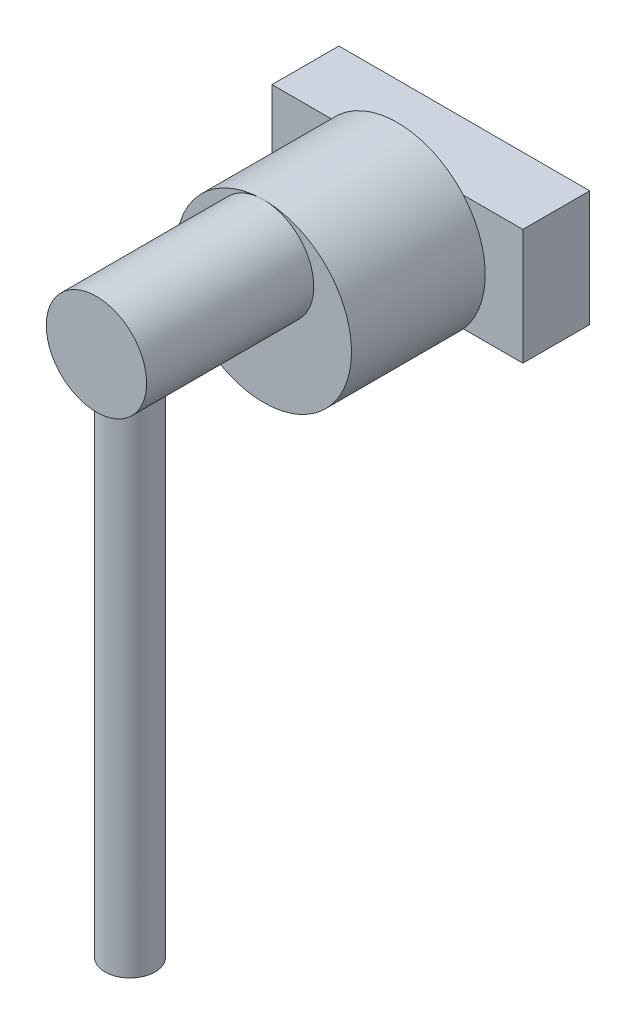
ISO-10303-21;
HEADER;
FILE_DESCRIPTION(('STEP AP214'),'2;1');
FILE_NAME('part.step','',(''),(''),'','','');
FILE_SCHEMA(('AUTOMOTIVE_DESIGN { 1 0 10303 214 1 1 1 1 }'));
ENDSEC;
DATA;
#1=APPLICATION_CONTEXT('core data for automotive mechanical design processes');
#2=APPLICATION_PROTOCOL_DEFINITION('international standard','automotive_design',2000,#1);
#3=PRODUCT_CONTEXT('',#1,'mechanical');
#4=PRODUCT('Part','Part','',(#3));
#5=PRODUCT_RELATED_PRODUCT_CATEGORY('part','',(#4));
#6=PRODUCT_DEFINITION_FORMATION('','',#4);
#7=PRODUCT_DEFINITION_CONTEXT('part definition',#1,'design');
#8=PRODUCT_DEFINITION('design','',#6,#7);
#9=PRODUCT_DEFINITION_SHAPE('','',#8);
#10=(LENGTH_UNIT() NAMED_UNIT(*) SI_UNIT(.MILLI.,.METRE.));
#11=(NAMED_UNIT(*) PLANE_ANGLE_UNIT() SI_UNIT($,.RADIAN.));
#12=(NAMED_UNIT(*) SI_UNIT($,.STERADIAN.) SOLID_ANGLE_UNIT());
#13=UNCERTAINTY_MEASURE_WITH_UNIT(LENGTH_MEASURE(1.E-05),#10,'distance_accuracy_value','');
#14=(GEOMETRIC_REPRESENTATION_CONTEXT(3) GLOBAL_UNCERTAINTY_ASSIGNED_CONTEXT((#13)) GLOBAL_UNIT_ASSIGNED_CONTEXT((#10,
#11,#12)) REPRESENTATION_CONTEXT('',''));
#15=CARTESIAN_POINT('',(0.,0.,0.));
#16=DIRECTION('',(0.,0.,1.));
#17=DIRECTION('',(1.,0.,0.));
#18=AXIS2_PLACEMENT_3D('',#15,#16,#17);
#19=CARTESIAN_POINT('',(0.,0.,76.2));
#20=DIRECTION('',(0.,0.,-1.));
#21=DIRECTION('',(-1.,0.,0.));
#22=AXIS2_PLACEMENT_3D('',#19,#20,#21);
#23=CYLINDRICAL_SURFACE('',#22,33.3375);
#24=CARTESIAN_POINT('',(0.,0.,25.4));
#25=DIRECTION('',(0.,0.,1.));
#26=DIRECTION('',(-1.,0.,0.));
#27=AXIS2_PLACEMENT_3D('',#24,#25,#26);
#28=CIRCLE('',#27,33.3375);
#29=CARTESIAN_POINT('',(-25.0477325570599,22.,25.4));
#30=VERTEX_POINT('',#29);
#31=CARTESIAN_POINT('',(-25.0477325570599,-22.,25.4));
#32=VERTEX_POINT('',#31);
#33=EDGE_CURVE('E81',#30,#32,#28,.T.);
#34=ORIENTED_EDGE('',*,*,#33,.T.);
#35=CARTESIAN_POINT('',(0.,0.,25.4));
#36=DIRECTION('',(0.,0.,1.));
#37=DIRECTION('',(-1.,0.,0.));
#38=AXIS2_PLACEMENT_3D('',#35,#36,#37);
#39=CIRCLE('',#38,33.3375);
#40=CARTESIAN_POINT('',(25.0477325570599,-22.,25.4));
#41=VERTEX_POINT('',#40);
#42=EDGE_CURVE('E85',#32,#41,#39,.T.);
#43=ORIENTED_EDGE('',*,*,#42,.T.);
#44=CARTESIAN_POINT('',(0.,0.,25.4));
#45=DIRECTION('',(0.,0.,1.));
#46=DIRECTION('',(-1.,0.,0.));
#47=AXIS2_PLACEMENT_3D('',#44,#45,#46);
#48=CIRCLE('',#47,33.3375);
#49=CARTESIAN_POINT('',(25.0477325570599,22.,25.4));
#50=VERTEX_POINT('',#49);
#51=EDGE_CURVE('E31',#41,#50,#48,.T.);
#52=ORIENTED_EDGE('',*,*,#51,.T.);
#53=CARTESIAN_POINT('',(0.,0.,25.4));
#54=DIRECTION('',(0.,0.,1.));
#55=DIRECTION('',(-1.,0.,0.));
#56=AXIS2_PLACEMENT_3D('',#53,#54,#55);
#57=CIRCLE('',#56,33.3375);
#58=EDGE_CURVE('E86',#50,#30,#57,.T.);
#59=ORIENTED_EDGE('',*,*,#58,.T.);
#60=EDGE_LOOP('',(#34,#43,#52,#59));
#61=FACE_BOUND('',#60,.T.);
#62=CARTESIAN_POINT('',(0.,0.,76.2));
#63=DIRECTION('',(0.,0.,-1.));
#64=DIRECTION('',(-1.,0.,0.));
#65=AXIS2_PLACEMENT_3D('',#62,#63,#64);
#66=CIRCLE('',#65,33.3375);
#67=CARTESIAN_POINT('',(0.,33.3375,76.2));
#68=VERTEX_POINT('',#67);
#69=EDGE_CURVE('E11',#68,#68,#66,.T.);
#70=ORIENTED_EDGE('',*,*,#69,.T.);
#71=EDGE_LOOP('',(#70));
#72=FACE_BOUND('',#71,.T.);
#73=ADVANCED_FACE('F16',(#61,#72),#23,.T.);
#74=CARTESIAN_POINT('',(0.,-190.5,126.942779755271));
#75=DIRECTION('',(0.,1.,0.));
#76=DIRECTION('',(0.,0.,1.));
#77=AXIS2_PLACEMENT_3D('',#74,#75,#76);
#78=CYLINDRICAL_SURFACE('',#77,9.52500000000001);
#79=CARTESIAN_POINT('',(0.,-4.7625,117.417779755271));
#80=CARTESIAN_POINT('',(0.25067092690493,-4.76250491696352,117.417774106221));
#81=CARTESIAN_POINT('',(0.501282882398853,-4.75754398678024,117.427681329356));
#82=CARTESIAN_POINT('',(1.00064222701787,-4.73784110377864,117.467177273856));
#83=CARTESIAN_POINT('',(1.24938922307418,-4.72309714456443,117.49677003252));
#84=CARTESIAN_POINT('',(1.74326699327054,-4.68418831822216,117.57532332017));
#85=CARTESIAN_POINT('',(1.98839439690143,-4.66001518230058,117.624300848931));
#86=CARTESIAN_POINT('',(2.47306145882082,-4.60286810479089,117.741055864461));
#87=CARTESIAN_POINT('',(2.71260134798185,-4.56989452753437,117.808832572962));
#88=CARTESIAN_POINT('',(3.18367976176072,-4.49609203942614,117.962192170798));
#89=CARTESIAN_POINT('',(3.41524391697784,-4.4552917450615,118.047710283064));
#90=CARTESIAN_POINT('',(3.86990663546901,-4.36672125635948,118.235886796309));
#91=CARTESIAN_POINT('',(4.09300513680623,-4.31895101104058,118.338545322661));
#92=CARTESIAN_POINT('',(4.52952109184044,-4.2175302506639,118.560120962896));
#93=CARTESIAN_POINT('',(4.74294012548301,-4.16388070018388,118.679035410569));
#94=CARTESIAN_POINT('',(5.15920547678612,-4.05184520303124,118.932310985793));
#95=CARTESIAN_POINT('',(5.36204757922594,-3.99345739136225,119.066678204373));
#96=CARTESIAN_POINT('',(5.76806922461112,-3.86958116121294,119.358505715835));
#97=CARTESIAN_POINT('',(5.97053386905561,-3.8038768856618,119.516869289623));
#98=CARTESIAN_POINT('',(6.36157867052324,-3.67010368679475,119.848996687232));
#99=CARTESIAN_POINT('',(6.55015803318135,-3.60203462851903,120.022761390887));
#100=CARTESIAN_POINT('',(6.91267977130811,-3.46510333151833,120.384871785093));
#101=CARTESIAN_POINT('',(7.08661351340234,-3.39624065177996,120.573225952055));
#102=CARTESIAN_POINT('',(7.41891766995845,-3.25942163397795,120.96356580246));
#103=CARTESIAN_POINT('',(7.5772851594479,-3.19146546831808,121.165554035827));
#104=CARTESIAN_POINT('',(7.88928200572318,-3.05300414351728,121.59848582946));
#105=CARTESIAN_POINT('',(8.04158127777333,-2.98271278872064,121.830459266949));
#106=CARTESIAN_POINT('',(8.32588849111664,-2.84746027235705,122.307873285036));
#107=CARTESIAN_POINT('',(8.45790502993469,-2.78249685783587,122.553308099372));
#108=CARTESIAN_POINT('',(8.70050324157085,-2.66013130143966,123.056290705558));
#109=CARTESIAN_POINT('',(8.81109131873917,-2.60272690204124,123.313834849594));
#110=CARTESIAN_POINT('',(9.00964497717165,-2.49765517258362,123.839425062946));
#111=CARTESIAN_POINT('',(9.0976130651066,-2.44998676373537,124.107469964807));
#112=CARTESIAN_POINT('',(9.24520740302859,-2.36888937148875,124.635743502098));
#113=CARTESIAN_POINT('',(9.30621352461951,-2.33477952283524,124.895481545254));
#114=CARTESIAN_POINT('',(9.40634895105267,-2.27832083862825,125.420413331775));
#115=CARTESIAN_POINT('',(9.44547919172484,-2.25597149997345,125.685606841256));
#116=CARTESIAN_POINT('',(9.50123288261028,-2.22401453180965,126.218891937457));
#117=CARTESIAN_POINT('',(9.51787531224036,-2.21439615767436,126.48698088757));
#118=CARTESIAN_POINT('',(9.52843663979708,-2.20830074795434,127.023743953905));
#119=CARTESIAN_POINT('',(9.52235770570331,-2.21182245859641,127.292418011854));
#120=CARTESIAN_POINT('',(9.48967778688657,-2.23063535925795,127.795653045898));
#121=CARTESIAN_POINT('',(9.46562595460762,-2.24446409038839,128.030440108235));
#122=CARTESIAN_POINT('',(9.40030646244944,-2.28169289937264,128.496916903453));
#123=CARTESIAN_POINT('',(9.35903311243631,-2.30509614067498,128.728605586466));
#124=CARTESIAN_POINT('',(9.2597548192715,-2.36070312704522,129.187243734083));
#125=CARTESIAN_POINT('',(9.20175215649459,-2.39290567264735,129.414193840086));
#126=CARTESIAN_POINT('',(9.0695904876735,-2.46513244811679,129.862148358766));
#127=CARTESIAN_POINT('',(8.99542503355187,-2.50515979899898,130.083150358825));
#128=CARTESIAN_POINT('',(8.82974833920996,-2.59287389894596,130.522953967367));
#129=CARTESIAN_POINT('',(8.73787928389968,-2.64071484433219,130.741589741636));
#130=CARTESIAN_POINT('',(8.53866258088931,-2.74206925881253,131.17040118048));
#131=CARTESIAN_POINT('',(8.43130979049634,-2.79558461100646,131.380574004425));
#132=CARTESIAN_POINT('',(8.20185612104422,-2.90692684706438,131.791550627954));
#133=CARTESIAN_POINT('',(8.07975291013749,-2.96475441207808,131.99235293921));
#134=CARTESIAN_POINT('',(7.82150366294823,-3.08335982391517,132.383799471538));
#135=CARTESIAN_POINT('',(7.68535677165925,-3.14413785024897,132.574443073056));
#136=CARTESIAN_POINT('',(7.38153095644948,-3.27513713861021,132.9684006445));
#137=CARTESIAN_POINT('',(7.21204328673772,-3.34557758157693,133.170249927116));
#138=CARTESIAN_POINT('',(6.85702801743778,-3.48664248215145,133.559130379429));
#139=CARTESIAN_POINT('',(6.67150443893934,-3.55726688934607,133.746165241508));
#140=CARTESIAN_POINT('',(6.28513261318282,-3.69698870315239,134.104638854419));
#141=CARTESIAN_POINT('',(6.08427291566825,-3.76608491815365,134.27606573847));
#142=CARTESIAN_POINT('',(5.6682866774142,-3.90098101375024,134.602153409784));
#143=CARTESIAN_POINT('',(5.45315829197509,-3.96678046619216,134.756812022356));
#144=CARTESIAN_POINT('',(4.99922594062599,-4.0964206483593,135.05515072214));
#145=CARTESIAN_POINT('',(4.75978351718836,-4.16002174612098,135.197966222729));
#146=CARTESIAN_POINT('',(4.26797596767547,-4.27996925349622,135.462636021021));
#147=CARTESIAN_POINT('',(4.01561662645192,-4.33631887163627,135.584499597294));
#148=CARTESIAN_POINT('',(3.49991235877756,-4.4400776791065,135.805897081463));
#149=CARTESIAN_POINT('',(3.23658303905939,-4.48749907337021,135.905461508269));
#150=CARTESIAN_POINT('',(2.70075199057212,-4.57203364237769,136.081218209056));
#151=CARTESIAN_POINT('',(2.42825383506503,-4.60915078188221,136.157419473646));
#152=CARTESIAN_POINT('',(1.80119860581986,-4.68044148465766,136.302857058946));
#153=CARTESIAN_POINT('',(1.44445784317496,-4.71107677673519,136.364578937776));
#154=CARTESIAN_POINT('',(0.725103224055987,-4.75210147612539,136.447034170594));
#155=CARTESIAN_POINT('',(0.362489953161313,-4.76249288968251,136.467771586299));
#156=CARTESIAN_POINT('',(-0.25067092690493,-4.76250491696352,136.467785404322));
#157=CARTESIAN_POINT('',(-0.501282882398852,-4.75754398678024,136.457878181187));
#158=CARTESIAN_POINT('',(-1.00064222701787,-4.73784110377865,136.418382236687));
#159=CARTESIAN_POINT('',(-1.24938922307418,-4.72309714456444,136.388789478023));
#160=CARTESIAN_POINT('',(-1.74326699327053,-4.68418831822216,136.310236190373));
#161=CARTESIAN_POINT('',(-1.98839439690143,-4.66001518230058,136.261258661612));
#162=CARTESIAN_POINT('',(-2.47306145882081,-4.60286810479089,136.144503646082));
#163=CARTESIAN_POINT('',(-2.71260134798184,-4.56989452753437,136.076726937581));
#164=CARTESIAN_POINT('',(-3.18367976176072,-4.49609203942614,135.923367339745));
#165=CARTESIAN_POINT('',(-3.41524391697784,-4.45529174506149,135.837849227479));
#166=CARTESIAN_POINT('',(-3.86990663546902,-4.36672125635948,135.649672714234));
#167=CARTESIAN_POINT('',(-4.09300513680623,-4.31895101104058,135.547014187881));
#168=CARTESIAN_POINT('',(-4.52952109184044,-4.2175302506639,135.325438547647));
#169=CARTESIAN_POINT('',(-4.74294012548302,-4.16388070018388,135.206524099973));
#170=CARTESIAN_POINT('',(-5.15920547678612,-4.05184520303124,134.95324852475));
#171=CARTESIAN_POINT('',(-5.36204757922594,-3.99345739136225,134.81888130617));
#172=CARTESIAN_POINT('',(-5.76806922461112,-3.86958116121294,134.527053794708));
#173=CARTESIAN_POINT('',(-5.97053386905561,-3.80387688566179,134.36869022092));
#174=CARTESIAN_POINT('',(-6.36157867052324,-3.67010368679475,134.036562823311));
#175=CARTESIAN_POINT('',(-6.55015803318134,-3.60203462851904,133.862798119656));
#176=CARTESIAN_POINT('',(-6.91267977130811,-3.46510333151834,133.50068772545));
#177=CARTESIAN_POINT('',(-7.08661351340233,-3.39624065177996,133.312333558488));
#178=CARTESIAN_POINT('',(-7.41891766995845,-3.25942163397794,132.921993708083));
#179=CARTESIAN_POINT('',(-7.5772851594479,-3.19146546831808,132.720005474716));
#180=CARTESIAN_POINT('',(-7.88928200572318,-3.05300414351728,132.287073681083));
#181=CARTESIAN_POINT('',(-8.04158127777334,-2.98271278872063,132.055100243594));
#182=CARTESIAN_POINT('',(-8.32588849111666,-2.84746027235704,131.577686225507));
#183=CARTESIAN_POINT('',(-8.4579050299347,-2.78249685783586,131.332251411171));
#184=CARTESIAN_POINT('',(-8.70050324157086,-2.66013130143965,130.829268804985));
#185=CARTESIAN_POINT('',(-8.81109131873917,-2.60272690204123,130.571724660949));
#186=CARTESIAN_POINT('',(-9.00964497717165,-2.49765517258362,130.046134447597));
#187=CARTESIAN_POINT('',(-9.09761306510661,-2.44998676373537,129.778089545736));
#188=CARTESIAN_POINT('',(-9.24520740302859,-2.36888937148875,129.249816008444));
#189=CARTESIAN_POINT('',(-9.3062135246195,-2.33477952283524,128.990077965288));
#190=CARTESIAN_POINT('',(-9.40634895105267,-2.27832083862825,128.465146178768));
#191=CARTESIAN_POINT('',(-9.44547919172483,-2.25597149997345,128.199952669287));
#192=CARTESIAN_POINT('',(-9.50123288261028,-2.22401453180964,127.666667573086));
#193=CARTESIAN_POINT('',(-9.51787531224036,-2.21439615767436,127.398578622973));
#194=CARTESIAN_POINT('',(-9.52843663979708,-2.20830074795434,126.861815556638));
#195=CARTESIAN_POINT('',(-9.52235770570331,-2.21182245859641,126.593141498689));
#196=CARTESIAN_POINT('',(-9.48967778688657,-2.23063535925794,126.089906464645));
#197=CARTESIAN_POINT('',(-9.46562595460762,-2.24446409038838,125.855119402308));
#198=CARTESIAN_POINT('',(-9.40030646244944,-2.28169289937264,125.38864260709));
#199=CARTESIAN_POINT('',(-9.3590331124363,-2.30509614067499,125.156953924077));
#200=CARTESIAN_POINT('',(-9.25975481927149,-2.36070312704522,124.698315776459));
#201=CARTESIAN_POINT('',(-9.20175215649458,-2.39290567264735,124.471365670457));
#202=CARTESIAN_POINT('',(-9.06959048767349,-2.46513244811679,124.023411151777));
#203=CARTESIAN_POINT('',(-8.99542503355187,-2.50515979899898,123.802409151718));
#204=CARTESIAN_POINT('',(-8.82974833920995,-2.59287389894596,123.362605543176));
#205=CARTESIAN_POINT('',(-8.73787928389967,-2.64071484433219,123.143969768906));
#206=CARTESIAN_POINT('',(-8.53866258088929,-2.74206925881254,122.715158330063));
#207=CARTESIAN_POINT('',(-8.43130979049633,-2.79558461100646,122.504985506118));
#208=CARTESIAN_POINT('',(-8.20185612104421,-2.90692684706439,122.094008882589));
#209=CARTESIAN_POINT('',(-8.07975291013749,-2.96475441207809,121.893206571333));
#210=CARTESIAN_POINT('',(-7.82150366294823,-3.08335982391517,121.501760039004));
#211=CARTESIAN_POINT('',(-7.68535677165924,-3.14413785024897,121.311116437487));
#212=CARTESIAN_POINT('',(-7.38153095644947,-3.27513713861022,120.917158866043));
#213=CARTESIAN_POINT('',(-7.21204328673771,-3.34557758157693,120.715309583427));
#214=CARTESIAN_POINT('',(-6.85702801743776,-3.48664248215145,120.326429131114));
#215=CARTESIAN_POINT('',(-6.67150443893931,-3.55726688934607,120.139394269035));
#216=CARTESIAN_POINT('',(-6.2851326131828,-3.6969887031524,119.780920656124));
#217=CARTESIAN_POINT('',(-6.08427291566822,-3.76608491815365,119.609493772072));
#218=CARTESIAN_POINT('',(-5.66828667741418,-3.90098101375025,119.283406100759));
#219=CARTESIAN_POINT('',(-5.45315829197508,-3.96678046619217,119.128747488187));
#220=CARTESIAN_POINT('',(-4.99922594062597,-4.0964206483593,118.830408788403));
#221=CARTESIAN_POINT('',(-4.75978351718834,-4.16002174612098,118.687593287814));
#222=CARTESIAN_POINT('',(-4.26797596767544,-4.27996925349622,118.422923489522));
#223=CARTESIAN_POINT('',(-4.01561662645189,-4.33631887163627,118.301059913249));
#224=CARTESIAN_POINT('',(-3.49991235877754,-4.4400776791065,118.07966242908));
#225=CARTESIAN_POINT('',(-3.23658303905937,-4.48749907337021,117.980098002274));
#226=CARTESIAN_POINT('',(-2.70075199057211,-4.57203364237769,117.804341301487));
#227=CARTESIAN_POINT('',(-2.42825383506503,-4.60915078188221,117.728140036897));
#228=CARTESIAN_POINT('',(-1.80119860581987,-4.68044148465766,117.582702451597));
#229=CARTESIAN_POINT('',(-1.44445784317496,-4.71107677673519,117.520980572767));
#230=CARTESIAN_POINT('',(-0.725103224055987,-4.75210147612539,117.438525339949));
#231=CARTESIAN_POINT('',(-0.362489953161313,-4.76249288968251,117.417787924244));
#232=CARTESIAN_POINT('',(0.,-4.7625,117.417779755271));
#233=B_SPLINE_CURVE_WITH_KNOTS('',3,(#79,#80,#81,#82,#83,#84,#85,#86,#87,#88,#89,#90,#91,#92,
#93,#94,#95,#96,#97,#98,#99,#100,#101,#102,#103,#104,#105,#106,#107,#108,#109,#110,#111,#112,
#113,#114,#115,#116,#117,#118,#119,#120,#121,#122,#123,#124,#125,#126,#127,#128,#129,#130,#131,
#132,#133,#134,#135,#136,#137,#138,#139,#140,#141,#142,#143,#144,#145,#146,#147,#148,#149,#150,
#151,#152,#153,#154,#155,#156,#157,#158,#159,#160,#161,#162,#163,#164,#165,#166,#167,#168,#169,
#170,#171,#172,#173,#174,#175,#176,#177,#178,#179,#180,#181,#182,#183,#184,#185,#186,#187,#188,
#189,#190,#191,#192,#193,#194,#195,#196,#197,#198,#199,#200,#201,#202,#203,#204,#205,#206,#207,
#208,#209,#210,#211,#212,#213,#214,#215,#216,#217,#218,#219,#220,#221,#222,#223,#224,#225,#226,
#227,#228,#229,#230,#231,#232),.UNSPECIFIED.,.T.,.F.,(4,2,2,2,2,2,2,2,2,2,2,2,2,2,2,2,2,2,2,2,2,
2,2,2,2,2,2,2,2,2,2,2,2,2,2,2,2,2,2,2,2,2,2,2,2,2,2,2,2,2,2,2,2,2,2,2,2,2,2,2,2,2,2,2,2,2,2,2,2,
2,2,2,2,2,2,2,4),(0.,0.751667814452766,1.50348983570209,2.25597264506879,3.00842430704921,
3.7581755162793,4.50793220982041,5.25756607949628,6.00749645229215,6.80257588806466,
7.59770077436357,8.39329114053934,9.18903071725677,10.0467569281846,10.904118553641,
11.761223541821,12.6182335075486,13.4240131701459,14.2297583595976,15.0348230850585,
15.8398109964972,16.5482380900525,17.2568994394457,17.9654642367349,18.674312232136,
19.3993669194153,20.1246629797809,20.8500738503372,21.5755289114082,22.3930951207262,
23.2104569124161,24.0284350453886,24.8465191359864,25.7032757981616,26.5596520623994,
27.4148490176398,28.2697164618484,29.356795211951,30.4437662229817,31.1954340374344,
31.9472560586838,32.6997388680505,33.4521905300309,34.201941739261,34.9516984328021,
35.701332302478,36.4512626752738,37.2463421110463,38.0414669973452,38.837057363521,
39.6327969402384,40.4905231511662,41.3478847766227,42.2049897648027,43.0619997305303,
43.8677793931275,44.6735245825792,45.4785893080401,46.2835772194788,46.9920043130341,
47.7006656624274,48.4092304597166,49.1180784551176,49.843133142397,50.5684292027626,
51.2938400733189,52.0192951343898,52.8368613437079,53.6542231353978,54.4722012683703,
55.2902853589681,56.1470420211433,57.0034182853811,57.8586152406215,58.7134826848301,
59.8005614349326,60.8875324459633),.UNSPECIFIED.);
#234=CARTESIAN_POINT('',(0.,-4.7625,117.417779755271));
#235=VERTEX_POINT('',#234);
#236=EDGE_CURVE('E20',#235,#235,#233,.T.);
#237=ORIENTED_EDGE('',*,*,#236,.T.);
#238=EDGE_LOOP('',(#237));
#239=FACE_BOUND('',#238,.T.);
#240=CARTESIAN_POINT('',(0.,-190.5,126.942779755271));
#241=DIRECTION('',(0.,1.,0.));
#242=DIRECTION('',(0.,0.,1.));
#243=AXIS2_PLACEMENT_3D('',#240,#241,#242);
#244=CIRCLE('',#243,9.52500000000001);
#245=CARTESIAN_POINT('',(0.,-190.5,136.467779755271));
#246=VERTEX_POINT('',#245);
#247=EDGE_CURVE('E89',#246,#246,#244,.T.);
#248=ORIENTED_EDGE('',*,*,#247,.T.);
#249=EDGE_LOOP('',(#248));
#250=FACE_BOUND('',#249,.T.);
#251=ADVANCED_FACE('F171',(#239,#250),#78,.T.);
#252=CARTESIAN_POINT('',(0.,14.2875,139.7));
#253=DIRECTION('',(0.,0.,-1.));
#254=DIRECTION('',(-1.,0.,0.));
#255=AXIS2_PLACEMENT_3D('',#252,#253,#254);
#256=CYLINDRICAL_SURFACE('',#255,19.05);
#257=CARTESIAN_POINT('',(0.,14.2875,76.2));
#258=DIRECTION('',(0.,0.,-1.));
#259=DIRECTION('',(-1.,0.,0.));
#260=AXIS2_PLACEMENT_3D('',#257,#258,#259);
#261=CIRCLE('',#260,19.05);
#262=EDGE_CURVE('E140',#68,#68,#261,.T.);
#263=ORIENTED_EDGE('',*,*,#262,.F.);
#264=EDGE_LOOP('',(#263));
#265=FACE_BOUND('',#264,.T.);
#266=CARTESIAN_POINT('',(0.,14.2875,139.7));
#267=DIRECTION('',(0.,0.,-1.));
#268=DIRECTION('',(-1.,0.,0.));
#269=AXIS2_PLACEMENT_3D('',#266,#267,#268);
#270=CIRCLE('',#269,19.05);
#271=CARTESIAN_POINT('',(-19.05,14.2875,139.7));
#272=VERTEX_POINT('',#271);
#273=EDGE_CURVE('E143',#272,#272,#270,.T.);
#274=ORIENTED_EDGE('',*,*,#273,.T.);
#275=EDGE_LOOP('',(#274));
#276=FACE_BOUND('',#275,.T.);
#277=ORIENTED_EDGE('',*,*,#236,.F.);
#278=EDGE_LOOP('',(#277));
#279=FACE_BOUND('',#278,.T.);
#280=ADVANCED_FACE('F176',(#265,#276,#279),#256,.T.);
#281=CARTESIAN_POINT('',(0.,0.,76.2));
#282=DIRECTION('',(0.,0.,1.));
#283=DIRECTION('',(1.,0.,0.));
#284=AXIS2_PLACEMENT_3D('',#281,#282,#283);
#285=PLANE('',#284);
#286=ORIENTED_EDGE('',*,*,#262,.T.);
#287=ORIENTED_EDGE('',*,*,#69,.F.);
#288=EDGE_LOOP('',(#286,#287));
#289=FACE_BOUND('',#288,.T.);
#290=ADVANCED_FACE('F168',(#289),#285,.T.);
#291=CARTESIAN_POINT('',(47.625,22.,0.));
#292=DIRECTION('',(0.,0.,-1.));
#293=DIRECTION('',(-1.,0.,0.));
#294=AXIS2_PLACEMENT_3D('',#291,#292,#293);
#295=PLANE('',#294);
#296=DIRECTION('',(0.,1.,0.));
#297=VECTOR('',#296,1.);
#298=CARTESIAN_POINT('',(-47.625,-22.,0.));
#299=LINE('',#298,#297);
#300=CARTESIAN_POINT('',(-47.625,-22.,0.));
#301=VERTEX_POINT('',#300);
#302=CARTESIAN_POINT('',(-47.625,22.,0.));
#303=VERTEX_POINT('',#302);
#304=EDGE_CURVE('E137',#301,#303,#299,.T.);
#305=ORIENTED_EDGE('',*,*,#304,.T.);
#306=DIRECTION('',(1.,0.,0.));
#307=VECTOR('',#306,1.);
#308=CARTESIAN_POINT('',(-47.625,22.,0.));
#309=LINE('',#308,#307);
#310=CARTESIAN_POINT('',(47.625,22.,0.));
#311=VERTEX_POINT('',#310);
#312=EDGE_CURVE('E134',#303,#311,#309,.T.);
#313=ORIENTED_EDGE('',*,*,#312,.T.);
#314=DIRECTION('',(0.,-1.,0.));
#315=VECTOR('',#314,1.);
#316=CARTESIAN_POINT('',(47.625,-22.,0.));
#317=LINE('',#316,#315);
#318=CARTESIAN_POINT('',(47.625,-22.,0.));
#319=VERTEX_POINT('',#318);
#320=EDGE_CURVE('E131',#311,#319,#317,.T.);
#321=ORIENTED_EDGE('',*,*,#320,.T.);
#322=DIRECTION('',(-1.,0.,0.));
#323=VECTOR('',#322,1.);
#324=CARTESIAN_POINT('',(-47.625,-22.,0.));
#325=LINE('',#324,#323);
#326=EDGE_CURVE('E128',#319,#301,#325,.T.);
#327=ORIENTED_EDGE('',*,*,#326,.T.);
#328=EDGE_LOOP('',(#305,#313,#321,#327));
#329=FACE_BOUND('',#328,.T.);
#330=ADVANCED_FACE('F156',(#329),#295,.T.);
#331=CARTESIAN_POINT('',(-47.625,-22.,25.4));
#332=DIRECTION('',(1.,0.,0.));
#333=DIRECTION('',(0.,0.,-1.));
#334=AXIS2_PLACEMENT_3D('',#331,#332,#333);
#335=PLANE('',#334);
#336=DIRECTION('',(0.,0.,-1.));
#337=VECTOR('',#336,1.);
#338=CARTESIAN_POINT('',(-47.625,-22.,25.4));
#339=LINE('',#338,#337);
#340=CARTESIAN_POINT('',(-47.625,-22.,25.4));
#341=VERTEX_POINT('',#340);
#342=EDGE_CURVE('E101',#341,#301,#339,.T.);
#343=ORIENTED_EDGE('',*,*,#342,.F.);
#344=DIRECTION('',(0.,1.,0.));
#345=VECTOR('',#344,1.);
#346=CARTESIAN_POINT('',(-47.625,22.,25.4));
#347=LINE('',#346,#345);
#348=CARTESIAN_POINT('',(-47.625,22.,25.4));
#349=VERTEX_POINT('',#348);
#350=EDGE_CURVE('E97',#341,#349,#347,.T.);
#351=ORIENTED_EDGE('',*,*,#350,.T.);
#352=DIRECTION('',(0.,0.,-1.));
#353=VECTOR('',#352,1.);
#354=CARTESIAN_POINT('',(-47.625,22.,25.4));
#355=LINE('',#354,#353);
#356=EDGE_CURVE('E125',#349,#303,#355,.T.);
#357=ORIENTED_EDGE('',*,*,#356,.T.);
#358=ORIENTED_EDGE('',*,*,#304,.F.);
#359=EDGE_LOOP('',(#343,#351,#357,#358));
#360=FACE_BOUND('',#359,.T.);
#361=ADVANCED_FACE('F159',(#360),#335,.F.);
#362=CARTESIAN_POINT('',(-47.625,22.,25.4));
#363=DIRECTION('',(0.,-1.,0.));
#364=DIRECTION('',(0.,0.,-1.));
#365=AXIS2_PLACEMENT_3D('',#362,#363,#364);
#366=PLANE('',#365);
#367=ORIENTED_EDGE('',*,*,#356,.F.);
#368=DIRECTION('',(1.,0.,0.));
#369=VECTOR('',#368,1.);
#370=CARTESIAN_POINT('',(47.625,22.,25.4));
#371=LINE('',#370,#369);
#372=EDGE_CURVE('E123',#349,#30,#371,.T.);
#373=ORIENTED_EDGE('',*,*,#372,.T.);
#374=DIRECTION('',(1.,0.,0.));
#375=VECTOR('',#374,1.);
#376=CARTESIAN_POINT('',(0.,22.,25.4));
#377=LINE('',#376,#375);
#378=EDGE_CURVE('E40',#30,#50,#377,.T.);
#379=ORIENTED_EDGE('',*,*,#378,.T.);
#380=DIRECTION('',(1.,0.,0.));
#381=VECTOR('',#380,1.);
#382=CARTESIAN_POINT('',(47.625,22.,25.4));
#383=LINE('',#382,#381);
#384=CARTESIAN_POINT('',(47.625,22.,25.4));
#385=VERTEX_POINT('',#384);
#386=EDGE_CURVE('E120',#50,#385,#383,.T.);
#387=ORIENTED_EDGE('',*,*,#386,.T.);
#388=DIRECTION('',(0.,0.,1.));
#389=VECTOR('',#388,1.);
#390=CARTESIAN_POINT('',(47.625,22.,25.4));
#391=LINE('',#390,#389);
#392=EDGE_CURVE('E118',#311,#385,#391,.T.);
#393=ORIENTED_EDGE('',*,*,#392,.F.);
#394=ORIENTED_EDGE('',*,*,#312,.F.);
#395=EDGE_LOOP('',(#367,#373,#379,#387,#393,#394));
#396=FACE_BOUND('',#395,.T.);
#397=ADVANCED_FACE('F152',(#396),#366,.F.);
#398=CARTESIAN_POINT('',(47.625,-22.,25.4));
#399=DIRECTION('',(-1.,0.,0.));
#400=DIRECTION('',(0.,0.,1.));
#401=AXIS2_PLACEMENT_3D('',#398,#399,#400);
#402=PLANE('',#401);
#403=ORIENTED_EDGE('',*,*,#392,.T.);
#404=DIRECTION('',(0.,-1.,0.));
#405=VECTOR('',#404,1.);
#406=CARTESIAN_POINT('',(47.625,22.,25.4));
#407=LINE('',#406,#405);
#408=CARTESIAN_POINT('',(47.625,-22.,25.4));
#409=VERTEX_POINT('',#408);
#410=EDGE_CURVE('E115',#385,#409,#407,.T.);
#411=ORIENTED_EDGE('',*,*,#410,.T.);
#412=DIRECTION('',(0.,0.,-1.));
#413=VECTOR('',#412,1.);
#414=CARTESIAN_POINT('',(47.625,-22.,25.4));
#415=LINE('',#414,#413);
#416=EDGE_CURVE('E112',#409,#319,#415,.T.);
#417=ORIENTED_EDGE('',*,*,#416,.T.);
#418=ORIENTED_EDGE('',*,*,#320,.F.);
#419=EDGE_LOOP('',(#403,#411,#417,#418));
#420=FACE_BOUND('',#419,.T.);
#421=ADVANCED_FACE('F154',(#420),#402,.F.);
#422=CARTESIAN_POINT('',(-47.625,-22.,25.4));
#423=DIRECTION('',(0.,1.,0.));
#424=DIRECTION('',(0.,0.,1.));
#425=AXIS2_PLACEMENT_3D('',#422,#423,#424);
#426=PLANE('',#425);
#427=ORIENTED_EDGE('',*,*,#416,.F.);
#428=DIRECTION('',(-1.,0.,0.));
#429=VECTOR('',#428,1.);
#430=CARTESIAN_POINT('',(47.625,-22.,25.4));
#431=LINE('',#430,#429);
#432=EDGE_CURVE('E105',#409,#41,#431,.T.);
#433=ORIENTED_EDGE('',*,*,#432,.T.);
#434=DIRECTION('',(-1.,0.,0.));
#435=VECTOR('',#434,1.);
#436=CARTESIAN_POINT('',(0.,-22.,25.4));
#437=LINE('',#436,#435);
#438=EDGE_CURVE('E100',#41,#32,#437,.T.);
#439=ORIENTED_EDGE('',*,*,#438,.T.);
#440=DIRECTION('',(-1.,0.,0.));
#441=VECTOR('',#440,1.);
#442=CARTESIAN_POINT('',(47.625,-22.,25.4));
#443=LINE('',#442,#441);
#444=EDGE_CURVE('E93',#32,#341,#443,.T.);
#445=ORIENTED_EDGE('',*,*,#444,.T.);
#446=ORIENTED_EDGE('',*,*,#342,.T.);
#447=ORIENTED_EDGE('',*,*,#326,.F.);
#448=EDGE_LOOP('',(#427,#433,#439,#445,#446,#447));
#449=FACE_BOUND('',#448,.T.);
#450=ADVANCED_FACE('F104',(#449),#426,.F.);
#451=CARTESIAN_POINT('',(47.625,22.,25.4));
#452=DIRECTION('',(0.,0.,-1.));
#453=DIRECTION('',(-1.,0.,0.));
#454=AXIS2_PLACEMENT_3D('',#451,#452,#453);
#455=PLANE('',#454);
#456=ORIENTED_EDGE('',*,*,#372,.F.);
#457=ORIENTED_EDGE('',*,*,#350,.F.);
#458=ORIENTED_EDGE('',*,*,#444,.F.);
#459=ORIENTED_EDGE('',*,*,#33,.F.);
#460=EDGE_LOOP('',(#456,#457,#458,#459));
#461=FACE_BOUND('',#460,.T.);
#462=ADVANCED_FACE('F95',(#461),#455,.F.);
#463=CARTESIAN_POINT('',(0.,0.,25.4));
#464=DIRECTION('',(0.,0.,1.));
#465=DIRECTION('',(1.,0.,0.));
#466=AXIS2_PLACEMENT_3D('',#463,#464,#465);
#467=PLANE('',#466);
#468=ORIENTED_EDGE('',*,*,#378,.F.);
#469=ORIENTED_EDGE('',*,*,#58,.F.);
#470=EDGE_LOOP('',(#468,#469));
#471=FACE_BOUND('',#470,.T.);
#472=ADVANCED_FACE('F208',(#471),#467,.F.);
#473=CARTESIAN_POINT('',(47.625,22.,25.4));
#474=DIRECTION('',(0.,0.,-1.));
#475=DIRECTION('',(-1.,0.,0.));
#476=AXIS2_PLACEMENT_3D('',#473,#474,#475);
#477=PLANE('',#476);
#478=ORIENTED_EDGE('',*,*,#432,.F.);
#479=ORIENTED_EDGE('',*,*,#410,.F.);
#480=ORIENTED_EDGE('',*,*,#386,.F.);
#481=ORIENTED_EDGE('',*,*,#51,.F.);
#482=EDGE_LOOP('',(#478,#479,#480,#481));
#483=FACE_BOUND('',#482,.T.);
#484=ADVANCED_FACE('F150',(#483),#477,.F.);
#485=CARTESIAN_POINT('',(0.,0.,25.4));
#486=DIRECTION('',(0.,0.,1.));
#487=DIRECTION('',(1.,0.,0.));
#488=AXIS2_PLACEMENT_3D('',#485,#486,#487);
#489=PLANE('',#488);
#490=ORIENTED_EDGE('',*,*,#438,.F.);
#491=ORIENTED_EDGE('',*,*,#42,.F.);
#492=EDGE_LOOP('',(#490,#491));
#493=FACE_BOUND('',#492,.T.);
#494=ADVANCED_FACE('F108',(#493),#489,.F.);
#495=CARTESIAN_POINT('',(0.,-190.5,126.942779755271));
#496=DIRECTION('',(0.,1.,0.));
#497=DIRECTION('',(0.,0.,1.));
#498=AXIS2_PLACEMENT_3D('',#495,#496,#497);
#499=PLANE('',#498);
#500=ORIENTED_EDGE('',*,*,#247,.F.);
#501=EDGE_LOOP('',(#500));
#502=FACE_BOUND('',#501,.T.);
#503=ADVANCED_FACE('F197',(#502),#499,.F.);
#504=CARTESIAN_POINT('',(0.,14.2875,139.7));
#505=DIRECTION('',(0.,0.,1.));
#506=DIRECTION('',(1.,0.,0.));
#507=AXIS2_PLACEMENT_3D('',#504,#505,#506);
#508=PLANE('',#507);
#509=ORIENTED_EDGE('',*,*,#273,.F.);
#510=EDGE_LOOP('',(#509));
#511=FACE_BOUND('',#510,.T.);
#512=ADVANCED_FACE('F18',(#511),#508,.T.);
#513=CLOSED_SHELL('',(#73,#251,#280,#290,#330,#361,#397,#421,#450,#462,#472,#484,#494,#503,#512));
#514=MANIFOLD_SOLID_BREP('B1',#513);
#515=ADVANCED_BREP_SHAPE_REPRESENTATION('',(#18,#514),#14);
#516=SHAPE_DEFINITION_REPRESENTATION(#9,#515);
ENDSEC;
END-ISO-10303-21;
